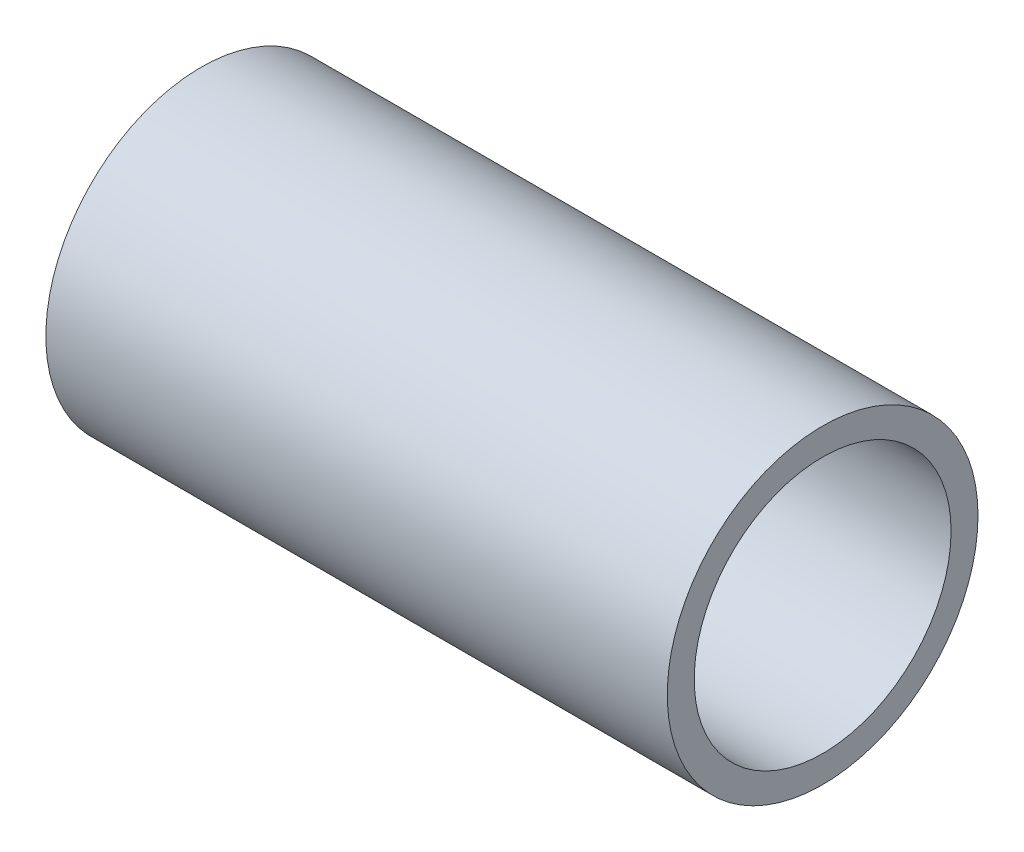
ISO-10303-21;
HEADER;
FILE_DESCRIPTION(('STEP AP214'),'2;1');
FILE_NAME('part.step','',(''),(''),'','','');
FILE_SCHEMA(('AUTOMOTIVE_DESIGN { 1 0 10303 214 1 1 1 1 }'));
ENDSEC;
DATA;
#1=APPLICATION_CONTEXT('core data for automotive mechanical design processes');
#2=APPLICATION_PROTOCOL_DEFINITION('international standard','automotive_design',2000,#1);
#3=PRODUCT_CONTEXT('',#1,'mechanical');
#4=PRODUCT('Part','Part','',(#3));
#5=PRODUCT_RELATED_PRODUCT_CATEGORY('part','',(#4));
#6=PRODUCT_DEFINITION_FORMATION('','',#4);
#7=PRODUCT_DEFINITION_CONTEXT('part definition',#1,'design');
#8=PRODUCT_DEFINITION('design','',#6,#7);
#9=PRODUCT_DEFINITION_SHAPE('','',#8);
#10=(LENGTH_UNIT() NAMED_UNIT(*) SI_UNIT(.MILLI.,.METRE.));
#11=(NAMED_UNIT(*) PLANE_ANGLE_UNIT() SI_UNIT($,.RADIAN.));
#12=(NAMED_UNIT(*) SI_UNIT($,.STERADIAN.) SOLID_ANGLE_UNIT());
#13=UNCERTAINTY_MEASURE_WITH_UNIT(LENGTH_MEASURE(1.E-05),#10,'distance_accuracy_value','');
#14=(GEOMETRIC_REPRESENTATION_CONTEXT(3) GLOBAL_UNCERTAINTY_ASSIGNED_CONTEXT((#13)) GLOBAL_UNIT_ASSIGNED_CONTEXT((#10,
#11,#12)) REPRESENTATION_CONTEXT('',''));
#15=CARTESIAN_POINT('',(0.,0.,0.));
#16=DIRECTION('',(0.,0.,1.));
#17=DIRECTION('',(1.,0.,0.));
#18=AXIS2_PLACEMENT_3D('',#15,#16,#17);
#19=CARTESIAN_POINT('',(19.05,0.,0.));
#20=DIRECTION('',(1.,0.,0.));
#21=DIRECTION('',(0.,0.,-1.));
#22=AXIS2_PLACEMENT_3D('',#19,#20,#21);
#23=PLANE('',#22);
#24=CARTESIAN_POINT('',(19.05,0.,0.));
#25=DIRECTION('',(1.,0.,0.));
#26=DIRECTION('',(0.,0.,-1.));
#27=AXIS2_PLACEMENT_3D('',#24,#25,#26);
#28=CIRCLE('',#27,9.525);
#29=CARTESIAN_POINT('',(19.05,0.,-9.525));
#30=VERTEX_POINT('',#29);
#31=EDGE_CURVE('E10',#30,#30,#28,.T.);
#32=ORIENTED_EDGE('',*,*,#31,.T.);
#33=EDGE_LOOP('',(#32));
#34=FACE_BOUND('',#33,.T.);
#35=CARTESIAN_POINT('',(19.05,0.,0.));
#36=DIRECTION('',(1.,0.,0.));
#37=DIRECTION('',(0.,0.,-1.));
#38=AXIS2_PLACEMENT_3D('',#35,#36,#37);
#39=CIRCLE('',#38,7.874);
#40=CARTESIAN_POINT('',(19.05,0.,-7.874));
#41=VERTEX_POINT('',#40);
#42=EDGE_CURVE('E42',#41,#41,#39,.T.);
#43=ORIENTED_EDGE('',*,*,#42,.F.);
#44=EDGE_LOOP('',(#43));
#45=FACE_BOUND('',#44,.T.);
#46=ADVANCED_FACE('F31',(#34,#45),#23,.T.);
#47=CARTESIAN_POINT('',(-19.05,0.,0.));
#48=DIRECTION('',(1.,0.,0.));
#49=DIRECTION('',(0.,0.,-1.));
#50=AXIS2_PLACEMENT_3D('',#47,#48,#49);
#51=PLANE('',#50);
#52=CARTESIAN_POINT('',(-19.05,0.,0.));
#53=DIRECTION('',(1.,0.,0.));
#54=DIRECTION('',(0.,0.,-1.));
#55=AXIS2_PLACEMENT_3D('',#52,#53,#54);
#56=CIRCLE('',#55,9.525);
#57=CARTESIAN_POINT('',(-19.05,0.,-9.525));
#58=VERTEX_POINT('',#57);
#59=EDGE_CURVE('E35',#58,#58,#56,.T.);
#60=ORIENTED_EDGE('',*,*,#59,.F.);
#61=EDGE_LOOP('',(#60));
#62=FACE_BOUND('',#61,.T.);
#63=CARTESIAN_POINT('',(-19.05,0.,0.));
#64=DIRECTION('',(1.,0.,0.));
#65=DIRECTION('',(0.,0.,-1.));
#66=AXIS2_PLACEMENT_3D('',#63,#64,#65);
#67=CIRCLE('',#66,7.874);
#68=CARTESIAN_POINT('',(-19.05,0.,-7.874));
#69=VERTEX_POINT('',#68);
#70=EDGE_CURVE('E44',#69,#69,#67,.T.);
#71=ORIENTED_EDGE('',*,*,#70,.T.);
#72=EDGE_LOOP('',(#71));
#73=FACE_BOUND('',#72,.T.);
#74=ADVANCED_FACE('F54',(#62,#73),#51,.F.);
#75=CARTESIAN_POINT('',(19.05,0.,0.));
#76=DIRECTION('',(-1.,0.,0.));
#77=DIRECTION('',(0.,0.,1.));
#78=AXIS2_PLACEMENT_3D('',#75,#76,#77);
#79=CYLINDRICAL_SURFACE('',#78,9.525);
#80=ORIENTED_EDGE('',*,*,#31,.F.);
#81=EDGE_LOOP('',(#80));
#82=FACE_BOUND('',#81,.T.);
#83=ORIENTED_EDGE('',*,*,#59,.T.);
#84=EDGE_LOOP('',(#83));
#85=FACE_BOUND('',#84,.T.);
#86=ADVANCED_FACE('F33',(#82,#85),#79,.T.);
#87=CARTESIAN_POINT('',(19.05,0.,0.));
#88=DIRECTION('',(-1.,0.,0.));
#89=DIRECTION('',(0.,0.,1.));
#90=AXIS2_PLACEMENT_3D('',#87,#88,#89);
#91=CYLINDRICAL_SURFACE('',#90,7.874);
#92=ORIENTED_EDGE('',*,*,#42,.T.);
#93=EDGE_LOOP('',(#92));
#94=FACE_BOUND('',#93,.T.);
#95=ORIENTED_EDGE('',*,*,#70,.F.);
#96=EDGE_LOOP('',(#95));
#97=FACE_BOUND('',#96,.T.);
#98=ADVANCED_FACE('F50',(#94,#97),#91,.F.);
#99=CLOSED_SHELL('',(#46,#74,#86,#98));
#100=MANIFOLD_SOLID_BREP('B2',#99);
#101=ADVANCED_BREP_SHAPE_REPRESENTATION('',(#18,#100),#14);
#102=SHAPE_DEFINITION_REPRESENTATION(#9,#101);
ENDSEC;
END-ISO-10303-21;
